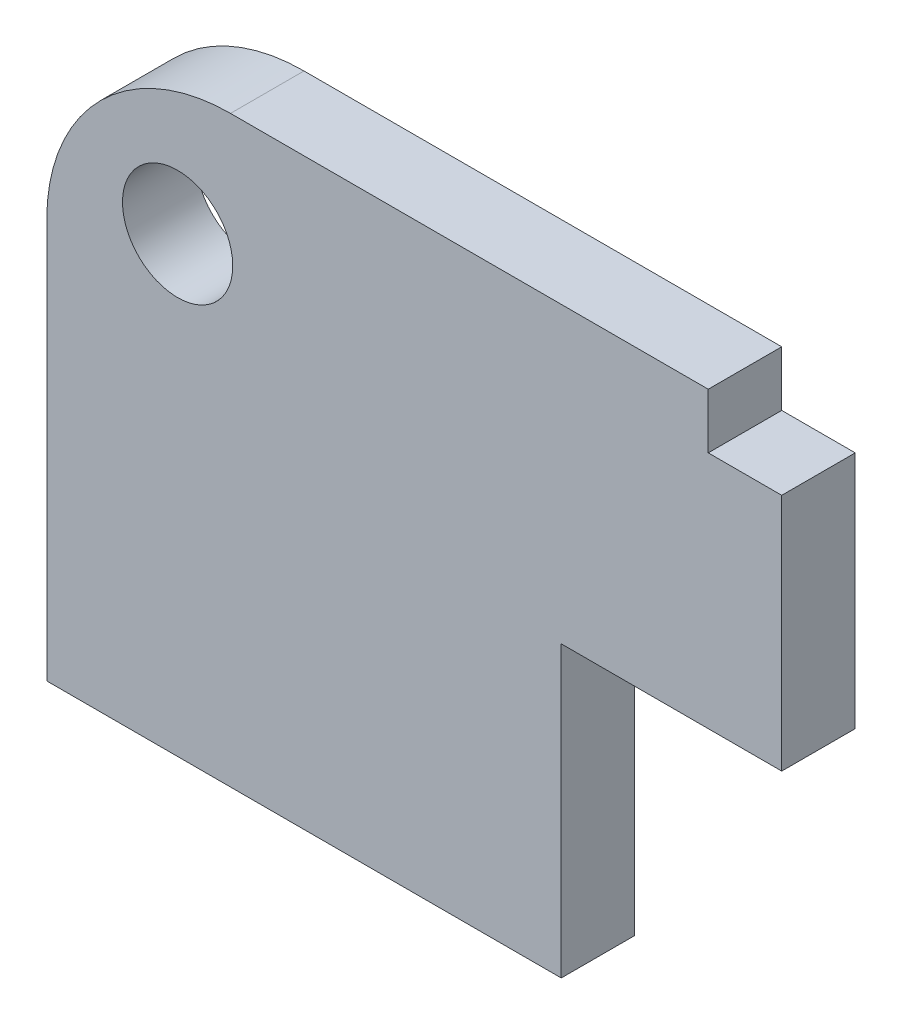
ISO-10303-21;
HEADER;
FILE_DESCRIPTION(('STEP AP214'),'2;1');
FILE_NAME('part.step','',(''),(''),'','','');
FILE_SCHEMA(('AUTOMOTIVE_DESIGN { 1 0 10303 214 1 1 1 1 }'));
ENDSEC;
DATA;
#1=APPLICATION_CONTEXT('core data for automotive mechanical design processes');
#2=APPLICATION_PROTOCOL_DEFINITION('international standard','automotive_design',2000,#1);
#3=PRODUCT_CONTEXT('',#1,'mechanical');
#4=PRODUCT('Part','Part','',(#3));
#5=PRODUCT_RELATED_PRODUCT_CATEGORY('part','',(#4));
#6=PRODUCT_DEFINITION_FORMATION('','',#4);
#7=PRODUCT_DEFINITION_CONTEXT('part definition',#1,'design');
#8=PRODUCT_DEFINITION('design','',#6,#7);
#9=PRODUCT_DEFINITION_SHAPE('','',#8);
#10=(LENGTH_UNIT() NAMED_UNIT(*) SI_UNIT(.MILLI.,.METRE.));
#11=(NAMED_UNIT(*) PLANE_ANGLE_UNIT() SI_UNIT($,.RADIAN.));
#12=(NAMED_UNIT(*) SI_UNIT($,.STERADIAN.) SOLID_ANGLE_UNIT());
#13=UNCERTAINTY_MEASURE_WITH_UNIT(LENGTH_MEASURE(1.E-05),#10,'distance_accuracy_value','');
#14=(GEOMETRIC_REPRESENTATION_CONTEXT(3) GLOBAL_UNCERTAINTY_ASSIGNED_CONTEXT((#13)) GLOBAL_UNIT_ASSIGNED_CONTEXT((#10,
#11,#12)) REPRESENTATION_CONTEXT('',''));
#15=CARTESIAN_POINT('',(0.,0.,0.));
#16=DIRECTION('',(0.,0.,1.));
#17=DIRECTION('',(1.,0.,0.));
#18=AXIS2_PLACEMENT_3D('',#15,#16,#17);
#19=CARTESIAN_POINT('',(5.,-5.,2.));
#20=DIRECTION('',(0.,0.,-1.));
#21=DIRECTION('',(-1.,0.,0.));
#22=AXIS2_PLACEMENT_3D('',#19,#20,#21);
#23=PLANE('',#22);
#24=CARTESIAN_POINT('',(5.,-5.,2.));
#25=DIRECTION('',(0.,0.,1.));
#26=DIRECTION('',(-1.,0.,0.));
#27=AXIS2_PLACEMENT_3D('',#24,#25,#26);
#28=CIRCLE('',#27,5.);
#29=CARTESIAN_POINT('',(5.00000000000004,0.,2.));
#30=VERTEX_POINT('',#29);
#31=CARTESIAN_POINT('',(0.,-5.00000000000004,2.));
#32=VERTEX_POINT('',#31);
#33=EDGE_CURVE('E152',#30,#32,#28,.T.);
#34=ORIENTED_EDGE('',*,*,#33,.T.);
#35=DIRECTION('',(0.,-1.,0.));
#36=VECTOR('',#35,1.);
#37=CARTESIAN_POINT('',(0.,-15.8756265982005,2.));
#38=LINE('',#37,#36);
#39=CARTESIAN_POINT('',(0.,-15.8756265982005,2.));
#40=VERTEX_POINT('',#39);
#41=EDGE_CURVE('E95',#32,#40,#38,.T.);
#42=ORIENTED_EDGE('',*,*,#41,.T.);
#43=DIRECTION('',(1.,0.,0.));
#44=VECTOR('',#43,1.);
#45=CARTESIAN_POINT('',(14.,-15.8756265982005,2.));
#46=LINE('',#45,#44);
#47=CARTESIAN_POINT('',(14.,-15.8756265982005,2.));
#48=VERTEX_POINT('',#47);
#49=EDGE_CURVE('E170',#40,#48,#46,.T.);
#50=ORIENTED_EDGE('',*,*,#49,.T.);
#51=DIRECTION('',(0.,1.,0.));
#52=VECTOR('',#51,1.);
#53=CARTESIAN_POINT('',(14.,-15.8756265982005,2.));
#54=LINE('',#53,#52);
#55=CARTESIAN_POINT('',(14.,-7.99999999999997,2.));
#56=VERTEX_POINT('',#55);
#57=EDGE_CURVE('E187',#48,#56,#54,.T.);
#58=ORIENTED_EDGE('',*,*,#57,.T.);
#59=DIRECTION('',(1.,0.,0.));
#60=VECTOR('',#59,1.);
#61=CARTESIAN_POINT('',(14.,-7.99999999999997,2.));
#62=LINE('',#61,#60);
#63=CARTESIAN_POINT('',(20.,-7.99999999999997,2.));
#64=VERTEX_POINT('',#63);
#65=EDGE_CURVE('E186',#56,#64,#62,.T.);
#66=ORIENTED_EDGE('',*,*,#65,.T.);
#67=DIRECTION('',(0.,1.,0.));
#68=VECTOR('',#67,1.);
#69=CARTESIAN_POINT('',(20.,-1.49999999999998,2.));
#70=LINE('',#69,#68);
#71=CARTESIAN_POINT('',(20.,-1.49999999999998,2.));
#72=VERTEX_POINT('',#71);
#73=EDGE_CURVE('E117',#64,#72,#70,.T.);
#74=ORIENTED_EDGE('',*,*,#73,.T.);
#75=DIRECTION('',(-1.,0.,0.));
#76=VECTOR('',#75,1.);
#77=CARTESIAN_POINT('',(20.,-1.49999999999998,2.));
#78=LINE('',#77,#76);
#79=CARTESIAN_POINT('',(18.,-1.49999999999998,2.));
#80=VERTEX_POINT('',#79);
#81=EDGE_CURVE('E111',#72,#80,#78,.T.);
#82=ORIENTED_EDGE('',*,*,#81,.T.);
#83=DIRECTION('',(0.,1.,0.));
#84=VECTOR('',#83,1.);
#85=CARTESIAN_POINT('',(18.,-1.49999999999998,2.));
#86=LINE('',#85,#84);
#87=CARTESIAN_POINT('',(18.,0.,2.));
#88=VERTEX_POINT('',#87);
#89=EDGE_CURVE('E115',#80,#88,#86,.T.);
#90=ORIENTED_EDGE('',*,*,#89,.T.);
#91=DIRECTION('',(-1.,0.,0.));
#92=VECTOR('',#91,1.);
#93=CARTESIAN_POINT('',(5.00000000000004,0.,2.));
#94=LINE('',#93,#92);
#95=EDGE_CURVE('E49',#88,#30,#94,.T.);
#96=ORIENTED_EDGE('',*,*,#95,.T.);
#97=EDGE_LOOP('',(#34,#42,#50,#58,#66,#74,#82,#90,#96));
#98=FACE_BOUND('',#97,.T.);
#99=CARTESIAN_POINT('',(3.56066017177984,-3.56066017177984,2.));
#100=DIRECTION('',(0.,0.,1.));
#101=DIRECTION('',(1.,0.,0.));
#102=AXIS2_PLACEMENT_3D('',#99,#100,#101);
#103=CIRCLE('',#102,1.5);
#104=CARTESIAN_POINT('',(5.06066017177984,-3.56066017177984,2.));
#105=VERTEX_POINT('',#104);
#106=EDGE_CURVE('E139',#105,#105,#103,.T.);
#107=ORIENTED_EDGE('',*,*,#106,.F.);
#108=EDGE_LOOP('',(#107));
#109=FACE_BOUND('',#108,.T.);
#110=ADVANCED_FACE('F32',(#98,#109),#23,.F.);
#111=CARTESIAN_POINT('',(5.,-5.,0.));
#112=DIRECTION('',(0.,0.,-1.));
#113=DIRECTION('',(-1.,0.,0.));
#114=AXIS2_PLACEMENT_3D('',#111,#112,#113);
#115=PLANE('',#114);
#116=CARTESIAN_POINT('',(5.,-5.,0.));
#117=DIRECTION('',(0.,0.,1.));
#118=DIRECTION('',(-1.,0.,0.));
#119=AXIS2_PLACEMENT_3D('',#116,#117,#118);
#120=CIRCLE('',#119,5.);
#121=CARTESIAN_POINT('',(5.00000000000004,0.,0.));
#122=VERTEX_POINT('',#121);
#123=CARTESIAN_POINT('',(0.,-5.00000000000004,0.));
#124=VERTEX_POINT('',#123);
#125=EDGE_CURVE('E135',#122,#124,#120,.T.);
#126=ORIENTED_EDGE('',*,*,#125,.F.);
#127=DIRECTION('',(-1.,0.,0.));
#128=VECTOR('',#127,1.);
#129=CARTESIAN_POINT('',(5.00000000000004,0.,0.));
#130=LINE('',#129,#128);
#131=CARTESIAN_POINT('',(18.,0.,0.));
#132=VERTEX_POINT('',#131);
#133=EDGE_CURVE('E87',#132,#122,#130,.T.);
#134=ORIENTED_EDGE('',*,*,#133,.F.);
#135=DIRECTION('',(0.,1.,0.));
#136=VECTOR('',#135,1.);
#137=CARTESIAN_POINT('',(18.,-1.49999999999998,0.));
#138=LINE('',#137,#136);
#139=CARTESIAN_POINT('',(18.,-1.49999999999998,0.));
#140=VERTEX_POINT('',#139);
#141=EDGE_CURVE('E81',#140,#132,#138,.T.);
#142=ORIENTED_EDGE('',*,*,#141,.F.);
#143=DIRECTION('',(-1.,0.,0.));
#144=VECTOR('',#143,1.);
#145=CARTESIAN_POINT('',(20.,-1.49999999999998,0.));
#146=LINE('',#145,#144);
#147=CARTESIAN_POINT('',(20.,-1.49999999999998,0.));
#148=VERTEX_POINT('',#147);
#149=EDGE_CURVE('E125',#148,#140,#146,.T.);
#150=ORIENTED_EDGE('',*,*,#149,.F.);
#151=DIRECTION('',(0.,1.,0.));
#152=VECTOR('',#151,1.);
#153=CARTESIAN_POINT('',(20.,-1.49999999999998,0.));
#154=LINE('',#153,#152);
#155=CARTESIAN_POINT('',(20.,-7.99999999999997,0.));
#156=VERTEX_POINT('',#155);
#157=EDGE_CURVE('E147',#156,#148,#154,.T.);
#158=ORIENTED_EDGE('',*,*,#157,.F.);
#159=DIRECTION('',(1.,0.,0.));
#160=VECTOR('',#159,1.);
#161=CARTESIAN_POINT('',(14.,-7.99999999999997,0.));
#162=LINE('',#161,#160);
#163=CARTESIAN_POINT('',(14.,-7.99999999999997,0.));
#164=VERTEX_POINT('',#163);
#165=EDGE_CURVE('E145',#164,#156,#162,.T.);
#166=ORIENTED_EDGE('',*,*,#165,.F.);
#167=DIRECTION('',(0.,1.,0.));
#168=VECTOR('',#167,1.);
#169=CARTESIAN_POINT('',(14.,-15.8756265982005,0.));
#170=LINE('',#169,#168);
#171=CARTESIAN_POINT('',(14.,-15.8756265982005,0.));
#172=VERTEX_POINT('',#171);
#173=EDGE_CURVE('E143',#172,#164,#170,.T.);
#174=ORIENTED_EDGE('',*,*,#173,.F.);
#175=DIRECTION('',(1.,0.,0.));
#176=VECTOR('',#175,1.);
#177=CARTESIAN_POINT('',(14.,-15.8756265982005,0.));
#178=LINE('',#177,#176);
#179=CARTESIAN_POINT('',(0.,-15.8756265982005,0.));
#180=VERTEX_POINT('',#179);
#181=EDGE_CURVE('E141',#180,#172,#178,.T.);
#182=ORIENTED_EDGE('',*,*,#181,.F.);
#183=DIRECTION('',(0.,-1.,0.));
#184=VECTOR('',#183,1.);
#185=CARTESIAN_POINT('',(0.,-15.8756265982005,0.));
#186=LINE('',#185,#184);
#187=EDGE_CURVE('E138',#124,#180,#186,.T.);
#188=ORIENTED_EDGE('',*,*,#187,.F.);
#189=EDGE_LOOP('',(#126,#134,#142,#150,#158,#166,#174,#182,#188));
#190=FACE_BOUND('',#189,.T.);
#191=CARTESIAN_POINT('',(3.56066017177984,-3.56066017177984,0.));
#192=DIRECTION('',(0.,0.,1.));
#193=DIRECTION('',(1.,0.,0.));
#194=AXIS2_PLACEMENT_3D('',#191,#192,#193);
#195=CIRCLE('',#194,1.5);
#196=CARTESIAN_POINT('',(5.06066017177984,-3.56066017177984,0.));
#197=VERTEX_POINT('',#196);
#198=EDGE_CURVE('E194',#197,#197,#195,.T.);
#199=ORIENTED_EDGE('',*,*,#198,.T.);
#200=EDGE_LOOP('',(#199));
#201=FACE_BOUND('',#200,.T.);
#202=ADVANCED_FACE('F174',(#190,#201),#115,.T.);
#203=CARTESIAN_POINT('',(5.,-5.,2.));
#204=DIRECTION('',(0.,0.,-1.));
#205=DIRECTION('',(-1.,0.,0.));
#206=AXIS2_PLACEMENT_3D('',#203,#204,#205);
#207=CYLINDRICAL_SURFACE('',#206,5.);
#208=ORIENTED_EDGE('',*,*,#125,.T.);
#209=DIRECTION('',(0.,0.,-1.));
#210=VECTOR('',#209,1.);
#211=CARTESIAN_POINT('',(0.,-5.00000000000004,2.));
#212=LINE('',#211,#210);
#213=EDGE_CURVE('E11',#32,#124,#212,.T.);
#214=ORIENTED_EDGE('',*,*,#213,.F.);
#215=ORIENTED_EDGE('',*,*,#33,.F.);
#216=DIRECTION('',(0.,0.,-1.));
#217=VECTOR('',#216,1.);
#218=CARTESIAN_POINT('',(5.00000000000004,0.,2.));
#219=LINE('',#218,#217);
#220=EDGE_CURVE('E131',#30,#122,#219,.T.);
#221=ORIENTED_EDGE('',*,*,#220,.T.);
#222=EDGE_LOOP('',(#208,#214,#215,#221));
#223=FACE_BOUND('',#222,.T.);
#224=ADVANCED_FACE('F34',(#223),#207,.T.);
#225=CARTESIAN_POINT('',(0.,-15.8756265982005,2.));
#226=DIRECTION('',(1.,0.,0.));
#227=DIRECTION('',(0.,0.,-1.));
#228=AXIS2_PLACEMENT_3D('',#225,#226,#227);
#229=PLANE('',#228);
#230=ORIENTED_EDGE('',*,*,#187,.T.);
#231=DIRECTION('',(0.,0.,-1.));
#232=VECTOR('',#231,1.);
#233=CARTESIAN_POINT('',(0.,-15.8756265982005,2.));
#234=LINE('',#233,#232);
#235=EDGE_CURVE('E41',#40,#180,#234,.T.);
#236=ORIENTED_EDGE('',*,*,#235,.F.);
#237=ORIENTED_EDGE('',*,*,#41,.F.);
#238=ORIENTED_EDGE('',*,*,#213,.T.);
#239=EDGE_LOOP('',(#230,#236,#237,#238));
#240=FACE_BOUND('',#239,.T.);
#241=ADVANCED_FACE('F226',(#240),#229,.F.);
#242=CARTESIAN_POINT('',(14.,-15.8756265982005,2.));
#243=DIRECTION('',(0.,1.,0.));
#244=DIRECTION('',(0.,0.,1.));
#245=AXIS2_PLACEMENT_3D('',#242,#243,#244);
#246=PLANE('',#245);
#247=ORIENTED_EDGE('',*,*,#181,.T.);
#248=DIRECTION('',(0.,0.,-1.));
#249=VECTOR('',#248,1.);
#250=CARTESIAN_POINT('',(14.,-15.8756265982005,2.));
#251=LINE('',#250,#249);
#252=EDGE_CURVE('E162',#48,#172,#251,.T.);
#253=ORIENTED_EDGE('',*,*,#252,.F.);
#254=ORIENTED_EDGE('',*,*,#49,.F.);
#255=ORIENTED_EDGE('',*,*,#235,.T.);
#256=EDGE_LOOP('',(#247,#253,#254,#255));
#257=FACE_BOUND('',#256,.T.);
#258=ADVANCED_FACE('F168',(#257),#246,.F.);
#259=CARTESIAN_POINT('',(14.,-15.8756265982005,2.));
#260=DIRECTION('',(-1.,0.,0.));
#261=DIRECTION('',(0.,0.,1.));
#262=AXIS2_PLACEMENT_3D('',#259,#260,#261);
#263=PLANE('',#262);
#264=ORIENTED_EDGE('',*,*,#173,.T.);
#265=DIRECTION('',(0.,0.,-1.));
#266=VECTOR('',#265,1.);
#267=CARTESIAN_POINT('',(14.,-7.99999999999997,2.));
#268=LINE('',#267,#266);
#269=EDGE_CURVE('E159',#56,#164,#268,.T.);
#270=ORIENTED_EDGE('',*,*,#269,.F.);
#271=ORIENTED_EDGE('',*,*,#57,.F.);
#272=ORIENTED_EDGE('',*,*,#252,.T.);
#273=EDGE_LOOP('',(#264,#270,#271,#272));
#274=FACE_BOUND('',#273,.T.);
#275=ADVANCED_FACE('F180',(#274),#263,.F.);
#276=CARTESIAN_POINT('',(14.,-7.99999999999997,2.));
#277=DIRECTION('',(0.,1.,0.));
#278=DIRECTION('',(0.,0.,1.));
#279=AXIS2_PLACEMENT_3D('',#276,#277,#278);
#280=PLANE('',#279);
#281=ORIENTED_EDGE('',*,*,#165,.T.);
#282=DIRECTION('',(0.,0.,-1.));
#283=VECTOR('',#282,1.);
#284=CARTESIAN_POINT('',(20.,-7.99999999999997,2.));
#285=LINE('',#284,#283);
#286=EDGE_CURVE('E156',#64,#156,#285,.T.);
#287=ORIENTED_EDGE('',*,*,#286,.F.);
#288=ORIENTED_EDGE('',*,*,#65,.F.);
#289=ORIENTED_EDGE('',*,*,#269,.T.);
#290=EDGE_LOOP('',(#281,#287,#288,#289));
#291=FACE_BOUND('',#290,.T.);
#292=ADVANCED_FACE('F184',(#291),#280,.F.);
#293=CARTESIAN_POINT('',(20.,-1.49999999999998,2.));
#294=DIRECTION('',(-1.,0.,0.));
#295=DIRECTION('',(0.,0.,1.));
#296=AXIS2_PLACEMENT_3D('',#293,#294,#295);
#297=PLANE('',#296);
#298=ORIENTED_EDGE('',*,*,#157,.T.);
#299=DIRECTION('',(0.,0.,-1.));
#300=VECTOR('',#299,1.);
#301=CARTESIAN_POINT('',(20.,-1.49999999999998,2.));
#302=LINE('',#301,#300);
#303=EDGE_CURVE('E126',#72,#148,#302,.T.);
#304=ORIENTED_EDGE('',*,*,#303,.F.);
#305=ORIENTED_EDGE('',*,*,#73,.F.);
#306=ORIENTED_EDGE('',*,*,#286,.T.);
#307=EDGE_LOOP('',(#298,#304,#305,#306));
#308=FACE_BOUND('',#307,.T.);
#309=ADVANCED_FACE('F217',(#308),#297,.F.);
#310=CARTESIAN_POINT('',(20.,-1.49999999999998,2.));
#311=DIRECTION('',(0.,-1.,0.));
#312=DIRECTION('',(1.,0.,0.));
#313=AXIS2_PLACEMENT_3D('',#310,#311,#312);
#314=PLANE('',#313);
#315=ORIENTED_EDGE('',*,*,#149,.T.);
#316=DIRECTION('',(0.,0.,-1.));
#317=VECTOR('',#316,1.);
#318=CARTESIAN_POINT('',(18.,-1.49999999999998,2.));
#319=LINE('',#318,#317);
#320=EDGE_CURVE('E122',#80,#140,#319,.T.);
#321=ORIENTED_EDGE('',*,*,#320,.F.);
#322=ORIENTED_EDGE('',*,*,#81,.F.);
#323=ORIENTED_EDGE('',*,*,#303,.T.);
#324=EDGE_LOOP('',(#315,#321,#322,#323));
#325=FACE_BOUND('',#324,.T.);
#326=ADVANCED_FACE('F123',(#325),#314,.F.);
#327=CARTESIAN_POINT('',(18.,-1.49999999999998,2.));
#328=DIRECTION('',(-1.,0.,0.));
#329=DIRECTION('',(0.,0.,1.));
#330=AXIS2_PLACEMENT_3D('',#327,#328,#329);
#331=PLANE('',#330);
#332=ORIENTED_EDGE('',*,*,#141,.T.);
#333=DIRECTION('',(0.,0.,-1.));
#334=VECTOR('',#333,1.);
#335=CARTESIAN_POINT('',(18.,0.,2.));
#336=LINE('',#335,#334);
#337=EDGE_CURVE('E127',#88,#132,#336,.T.);
#338=ORIENTED_EDGE('',*,*,#337,.F.);
#339=ORIENTED_EDGE('',*,*,#89,.F.);
#340=ORIENTED_EDGE('',*,*,#320,.T.);
#341=EDGE_LOOP('',(#332,#338,#339,#340));
#342=FACE_BOUND('',#341,.T.);
#343=ADVANCED_FACE('F129',(#342),#331,.F.);
#344=CARTESIAN_POINT('',(5.00000000000004,0.,2.));
#345=DIRECTION('',(0.,-1.,0.));
#346=DIRECTION('',(0.,0.,-1.));
#347=AXIS2_PLACEMENT_3D('',#344,#345,#346);
#348=PLANE('',#347);
#349=ORIENTED_EDGE('',*,*,#133,.T.);
#350=ORIENTED_EDGE('',*,*,#220,.F.);
#351=ORIENTED_EDGE('',*,*,#95,.F.);
#352=ORIENTED_EDGE('',*,*,#337,.T.);
#353=EDGE_LOOP('',(#349,#350,#351,#352));
#354=FACE_BOUND('',#353,.T.);
#355=ADVANCED_FACE('F210',(#354),#348,.F.);
#356=CARTESIAN_POINT('',(3.56066017177984,-3.56066017177984,2.));
#357=DIRECTION('',(0.,0.,-1.));
#358=DIRECTION('',(-1.,0.,0.));
#359=AXIS2_PLACEMENT_3D('',#356,#357,#358);
#360=CYLINDRICAL_SURFACE('',#359,1.5);
#361=ORIENTED_EDGE('',*,*,#106,.T.);
#362=EDGE_LOOP('',(#361));
#363=FACE_BOUND('',#362,.T.);
#364=ORIENTED_EDGE('',*,*,#198,.F.);
#365=EDGE_LOOP('',(#364));
#366=FACE_BOUND('',#365,.T.);
#367=ADVANCED_FACE('F200',(#363,#366),#360,.F.);
#368=CLOSED_SHELL('',(#110,#202,#224,#241,#258,#275,#292,#309,#326,#343,#355,#367));
#369=MANIFOLD_SOLID_BREP('B2',#368);
#370=ADVANCED_BREP_SHAPE_REPRESENTATION('',(#18,#369),#14);
#371=SHAPE_DEFINITION_REPRESENTATION(#9,#370);
ENDSEC;
END-ISO-10303-21;
